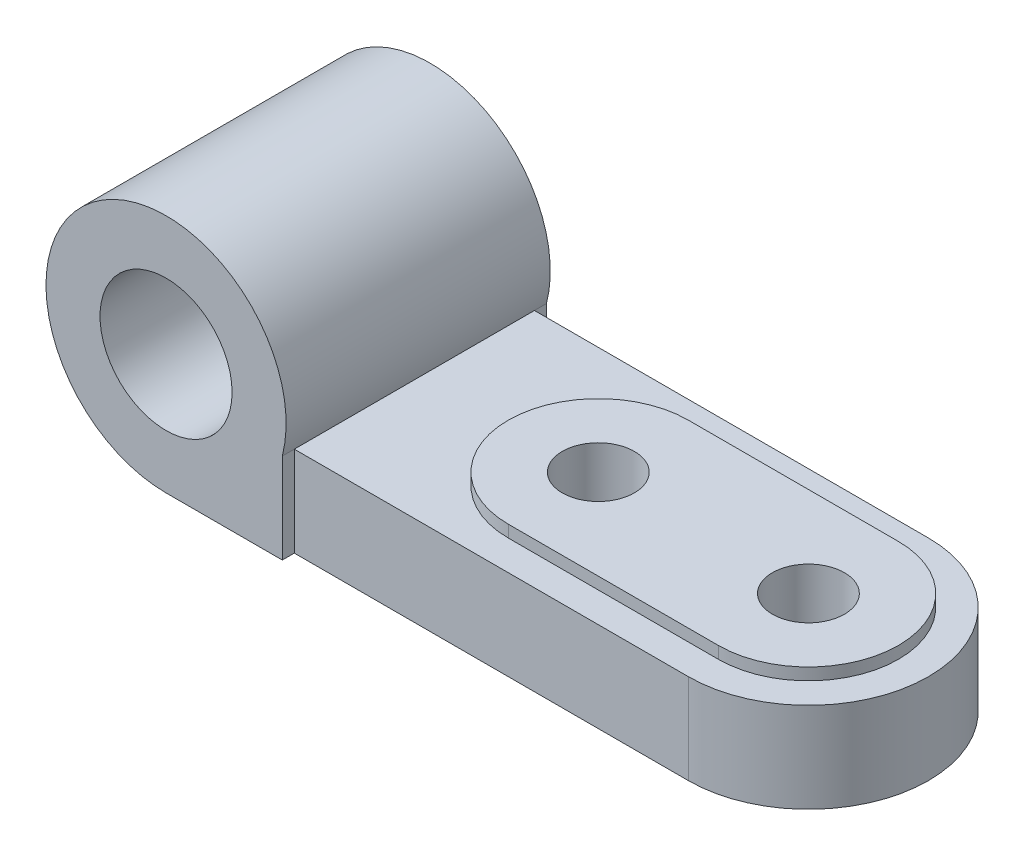
ISO-10303-21;
HEADER;
FILE_DESCRIPTION(('STEP AP214'),'2;1');
FILE_NAME('part.step','',(''),(''),'','','');
FILE_SCHEMA(('AUTOMOTIVE_DESIGN { 1 0 10303 214 1 1 1 1 }'));
ENDSEC;
DATA;
#1=APPLICATION_CONTEXT('core data for automotive mechanical design processes');
#2=APPLICATION_PROTOCOL_DEFINITION('international standard','automotive_design',2000,#1);
#3=PRODUCT_CONTEXT('',#1,'mechanical');
#4=PRODUCT('Part','Part','',(#3));
#5=PRODUCT_RELATED_PRODUCT_CATEGORY('part','',(#4));
#6=PRODUCT_DEFINITION_FORMATION('','',#4);
#7=PRODUCT_DEFINITION_CONTEXT('part definition',#1,'design');
#8=PRODUCT_DEFINITION('design','',#6,#7);
#9=PRODUCT_DEFINITION_SHAPE('','',#8);
#10=(LENGTH_UNIT() NAMED_UNIT(*) SI_UNIT(.MILLI.,.METRE.));
#11=(NAMED_UNIT(*) PLANE_ANGLE_UNIT() SI_UNIT($,.RADIAN.));
#12=(NAMED_UNIT(*) SI_UNIT($,.STERADIAN.) SOLID_ANGLE_UNIT());
#13=UNCERTAINTY_MEASURE_WITH_UNIT(LENGTH_MEASURE(1.E-05),#10,'distance_accuracy_value','');
#14=(GEOMETRIC_REPRESENTATION_CONTEXT(3) GLOBAL_UNCERTAINTY_ASSIGNED_CONTEXT((#13)) GLOBAL_UNIT_ASSIGNED_CONTEXT((#10,
#11,#12)) REPRESENTATION_CONTEXT('',''));
#15=CARTESIAN_POINT('',(0.,0.,0.));
#16=DIRECTION('',(0.,0.,1.));
#17=DIRECTION('',(1.,0.,0.));
#18=AXIS2_PLACEMENT_3D('',#15,#16,#17);
#19=CARTESIAN_POINT('',(0.,-5.,44.));
#20=DIRECTION('',(0.,-1.,0.));
#21=DIRECTION('',(0.,0.,-1.));
#22=AXIS2_PLACEMENT_3D('',#19,#20,#21);
#23=PLANE('',#22);
#24=CARTESIAN_POINT('',(27.1908602150537,-5.,22.));
#25=DIRECTION('',(0.,1.,0.));
#26=DIRECTION('',(0.,0.,1.));
#27=AXIS2_PLACEMENT_3D('',#24,#25,#26);
#28=CIRCLE('',#27,20.);
#29=CARTESIAN_POINT('',(27.1908602150537,-5.,42.));
#30=VERTEX_POINT('',#29);
#31=CARTESIAN_POINT('',(27.1908602150537,-5.,2.));
#32=VERTEX_POINT('',#31);
#33=EDGE_CURVE('E58',#30,#32,#28,.T.);
#34=ORIENTED_EDGE('',*,*,#33,.T.);
#35=DIRECTION('',(1.,0.,0.));
#36=VECTOR('',#35,1.);
#37=CARTESIAN_POINT('',(0.,-5.,2.));
#38=LINE('',#37,#36);
#39=CARTESIAN_POINT('',(-38.4442230539092,-5.,2.));
#40=VERTEX_POINT('',#39);
#41=EDGE_CURVE('E147',#40,#32,#38,.T.);
#42=ORIENTED_EDGE('',*,*,#41,.F.);
#43=DIRECTION('',(0.,0.,-1.));
#44=VECTOR('',#43,1.);
#45=CARTESIAN_POINT('',(-38.4442230539092,-5.,44.));
#46=LINE('',#45,#44);
#47=CARTESIAN_POINT('',(-38.4442230539092,-5.,42.));
#48=VERTEX_POINT('',#47);
#49=EDGE_CURVE('E188',#48,#40,#46,.T.);
#50=ORIENTED_EDGE('',*,*,#49,.F.);
#51=DIRECTION('',(-1.,0.,0.));
#52=VECTOR('',#51,1.);
#53=CARTESIAN_POINT('',(0.,-5.,42.));
#54=LINE('',#53,#52);
#55=EDGE_CURVE('E166',#30,#48,#54,.T.);
#56=ORIENTED_EDGE('',*,*,#55,.F.);
#57=EDGE_LOOP('',(#34,#42,#50,#56));
#58=FACE_BOUND('',#57,.T.);
#59=CARTESIAN_POINT('',(-7.80913978494626,-5.,22.));
#60=DIRECTION('',(0.,1.,0.));
#61=DIRECTION('',(0.,0.,1.));
#62=AXIS2_PLACEMENT_3D('',#59,#60,#61);
#63=CIRCLE('',#62,15.);
#64=CARTESIAN_POINT('',(-7.80913978494626,-5.,7.));
#65=VERTEX_POINT('',#64);
#66=CARTESIAN_POINT('',(-7.80913978494626,-5.,37.));
#67=VERTEX_POINT('',#66);
#68=EDGE_CURVE('E142',#65,#67,#63,.T.);
#69=ORIENTED_EDGE('',*,*,#68,.F.);
#70=DIRECTION('',(1.,0.,0.));
#71=VECTOR('',#70,1.);
#72=CARTESIAN_POINT('',(0.,-5.,7.));
#73=LINE('',#72,#71);
#74=CARTESIAN_POINT('',(27.1908602150537,-5.,7.));
#75=VERTEX_POINT('',#74);
#76=EDGE_CURVE('E138',#65,#75,#73,.T.);
#77=ORIENTED_EDGE('',*,*,#76,.T.);
#78=CARTESIAN_POINT('',(27.1908602150537,-5.,22.));
#79=DIRECTION('',(0.,1.,0.));
#80=DIRECTION('',(0.,0.,1.));
#81=AXIS2_PLACEMENT_3D('',#78,#79,#80);
#82=CIRCLE('',#81,15.);
#83=CARTESIAN_POINT('',(27.1908602150537,-5.,37.));
#84=VERTEX_POINT('',#83);
#85=EDGE_CURVE('E50',#84,#75,#82,.T.);
#86=ORIENTED_EDGE('',*,*,#85,.F.);
#87=DIRECTION('',(1.,0.,0.));
#88=VECTOR('',#87,1.);
#89=CARTESIAN_POINT('',(0.,-5.,37.));
#90=LINE('',#89,#88);
#91=EDGE_CURVE('E300',#67,#84,#90,.T.);
#92=ORIENTED_EDGE('',*,*,#91,.F.);
#93=EDGE_LOOP('',(#69,#77,#86,#92));
#94=FACE_BOUND('',#93,.T.);
#95=ADVANCED_FACE('F35',(#58,#94),#23,.F.);
#96=CARTESIAN_POINT('',(0.,-20.,44.));
#97=DIRECTION('',(0.,1.,0.));
#98=DIRECTION('',(0.,0.,1.));
#99=AXIS2_PLACEMENT_3D('',#96,#97,#98);
#100=PLANE('',#99);
#101=CARTESIAN_POINT('',(27.1908602150537,-20.,22.));
#102=DIRECTION('',(0.,1.,0.));
#103=DIRECTION('',(0.,0.,1.));
#104=AXIS2_PLACEMENT_3D('',#101,#102,#103);
#105=CIRCLE('',#104,6.);
#106=CARTESIAN_POINT('',(27.1908602150537,-20.,28.));
#107=VERTEX_POINT('',#106);
#108=EDGE_CURVE('E297',#107,#107,#105,.T.);
#109=ORIENTED_EDGE('',*,*,#108,.T.);
#110=EDGE_LOOP('',(#109));
#111=FACE_BOUND('',#110,.T.);
#112=CARTESIAN_POINT('',(-7.80913978494626,-20.,22.));
#113=DIRECTION('',(0.,1.,0.));
#114=DIRECTION('',(0.,0.,1.));
#115=AXIS2_PLACEMENT_3D('',#112,#113,#114);
#116=CIRCLE('',#115,6.);
#117=CARTESIAN_POINT('',(-7.80913978494626,-20.,28.));
#118=VERTEX_POINT('',#117);
#119=EDGE_CURVE('E298',#118,#118,#116,.T.);
#120=ORIENTED_EDGE('',*,*,#119,.T.);
#121=EDGE_LOOP('',(#120));
#122=FACE_BOUND('',#121,.T.);
#123=DIRECTION('',(1.,0.,0.));
#124=VECTOR('',#123,1.);
#125=CARTESIAN_POINT('',(0.,-20.,2.));
#126=LINE('',#125,#124);
#127=CARTESIAN_POINT('',(-38.4442230539092,-20.,2.));
#128=VERTEX_POINT('',#127);
#129=CARTESIAN_POINT('',(27.1908602150537,-20.,2.));
#130=VERTEX_POINT('',#129);
#131=EDGE_CURVE('E162',#128,#130,#126,.T.);
#132=ORIENTED_EDGE('',*,*,#131,.T.);
#133=CARTESIAN_POINT('',(27.1908602150537,-20.,22.));
#134=DIRECTION('',(0.,1.,0.));
#135=DIRECTION('',(0.,0.,1.));
#136=AXIS2_PLACEMENT_3D('',#133,#134,#135);
#137=CIRCLE('',#136,20.);
#138=CARTESIAN_POINT('',(27.1908602150537,-20.,42.));
#139=VERTEX_POINT('',#138);
#140=EDGE_CURVE('E182',#139,#130,#137,.T.);
#141=ORIENTED_EDGE('',*,*,#140,.F.);
#142=DIRECTION('',(-1.,0.,0.));
#143=VECTOR('',#142,1.);
#144=CARTESIAN_POINT('',(0.,-20.,42.));
#145=LINE('',#144,#143);
#146=CARTESIAN_POINT('',(-38.4442230539092,-20.,42.));
#147=VERTEX_POINT('',#146);
#148=EDGE_CURVE('E173',#139,#147,#145,.T.);
#149=ORIENTED_EDGE('',*,*,#148,.T.);
#150=DIRECTION('',(0.,0.,1.));
#151=VECTOR('',#150,1.);
#152=CARTESIAN_POINT('',(-38.4442230539092,-20.,44.));
#153=LINE('',#152,#151);
#154=CARTESIAN_POINT('',(-38.4442230539092,-20.,44.));
#155=VERTEX_POINT('',#154);
#156=EDGE_CURVE('E179',#147,#155,#153,.T.);
#157=ORIENTED_EDGE('',*,*,#156,.T.);
#158=DIRECTION('',(1.,0.,0.));
#159=VECTOR('',#158,1.);
#160=CARTESIAN_POINT('',(0.,-20.,44.));
#161=LINE('',#160,#159);
#162=CARTESIAN_POINT('',(-57.8091397849463,-20.,44.));
#163=VERTEX_POINT('',#162);
#164=EDGE_CURVE('E185',#163,#155,#161,.T.);
#165=ORIENTED_EDGE('',*,*,#164,.F.);
#166=DIRECTION('',(0.,0.,-1.));
#167=VECTOR('',#166,1.);
#168=CARTESIAN_POINT('',(-57.8091397849463,-20.,44.));
#169=LINE('',#168,#167);
#170=CARTESIAN_POINT('',(-57.8091397849463,-20.,0.));
#171=VERTEX_POINT('',#170);
#172=EDGE_CURVE('E194',#163,#171,#169,.T.);
#173=ORIENTED_EDGE('',*,*,#172,.T.);
#174=DIRECTION('',(1.,0.,0.));
#175=VECTOR('',#174,1.);
#176=CARTESIAN_POINT('',(0.,-20.,0.));
#177=LINE('',#176,#175);
#178=CARTESIAN_POINT('',(-38.4442230539092,-20.,0.));
#179=VERTEX_POINT('',#178);
#180=EDGE_CURVE('E184',#171,#179,#177,.T.);
#181=ORIENTED_EDGE('',*,*,#180,.T.);
#182=DIRECTION('',(0.,0.,1.));
#183=VECTOR('',#182,1.);
#184=CARTESIAN_POINT('',(-38.4442230539092,-20.,44.));
#185=LINE('',#184,#183);
#186=EDGE_CURVE('E158',#179,#128,#185,.T.);
#187=ORIENTED_EDGE('',*,*,#186,.T.);
#188=EDGE_LOOP('',(#132,#141,#149,#157,#165,#173,#181,#187));
#189=FACE_BOUND('',#188,.T.);
#190=ADVANCED_FACE('F215',(#111,#122,#189),#100,.F.);
#191=CARTESIAN_POINT('',(-57.8091397849463,0.,44.));
#192=DIRECTION('',(0.,0.,-1.));
#193=DIRECTION('',(-1.,0.,0.));
#194=AXIS2_PLACEMENT_3D('',#191,#192,#193);
#195=CYLINDRICAL_SURFACE('',#194,20.);
#196=ORIENTED_EDGE('',*,*,#172,.F.);
#197=CARTESIAN_POINT('',(-57.8091397849463,0.,44.));
#198=DIRECTION('',(0.,0.,1.));
#199=DIRECTION('',(1.,0.,0.));
#200=AXIS2_PLACEMENT_3D('',#197,#198,#199);
#201=CIRCLE('',#200,20.);
#202=CARTESIAN_POINT('',(-38.4442230539092,-5.,44.));
#203=VERTEX_POINT('',#202);
#204=EDGE_CURVE('E43',#203,#163,#201,.T.);
#205=ORIENTED_EDGE('',*,*,#204,.F.);
#206=EDGE_CURVE('E191',#203,#48,#46,.T.);
#207=ORIENTED_EDGE('',*,*,#206,.T.);
#208=ORIENTED_EDGE('',*,*,#49,.T.);
#209=DIRECTION('',(0.,0.,1.));
#210=VECTOR('',#209,1.);
#211=CARTESIAN_POINT('',(-38.4442230539092,-5.,0.));
#212=LINE('',#211,#210);
#213=CARTESIAN_POINT('',(-38.4442230539092,-5.,0.));
#214=VERTEX_POINT('',#213);
#215=EDGE_CURVE('E144',#214,#40,#212,.T.);
#216=ORIENTED_EDGE('',*,*,#215,.F.);
#217=CARTESIAN_POINT('',(-57.8091397849463,0.,0.));
#218=DIRECTION('',(0.,0.,1.));
#219=DIRECTION('',(1.,0.,0.));
#220=AXIS2_PLACEMENT_3D('',#217,#218,#219);
#221=CIRCLE('',#220,20.);
#222=EDGE_CURVE('E201',#214,#171,#221,.T.);
#223=ORIENTED_EDGE('',*,*,#222,.T.);
#224=EDGE_LOOP('',(#196,#205,#207,#208,#216,#223));
#225=FACE_BOUND('',#224,.T.);
#226=ADVANCED_FACE('F208',(#225),#195,.T.);
#227=CARTESIAN_POINT('',(-57.8091397849463,0.,44.));
#228=DIRECTION('',(0.,0.,-1.));
#229=DIRECTION('',(-1.,0.,0.));
#230=AXIS2_PLACEMENT_3D('',#227,#228,#229);
#231=CYLINDRICAL_SURFACE('',#230,11.);
#232=CARTESIAN_POINT('',(-57.8091397849463,0.,44.));
#233=DIRECTION('',(0.,0.,1.));
#234=DIRECTION('',(1.,0.,0.));
#235=AXIS2_PLACEMENT_3D('',#232,#233,#234);
#236=CIRCLE('',#235,11.);
#237=CARTESIAN_POINT('',(-46.8091397849463,0.,44.));
#238=VERTEX_POINT('',#237);
#239=EDGE_CURVE('E198',#238,#238,#236,.T.);
#240=ORIENTED_EDGE('',*,*,#239,.T.);
#241=EDGE_LOOP('',(#240));
#242=FACE_BOUND('',#241,.T.);
#243=CARTESIAN_POINT('',(-57.8091397849463,0.,0.));
#244=DIRECTION('',(0.,0.,1.));
#245=DIRECTION('',(1.,0.,0.));
#246=AXIS2_PLACEMENT_3D('',#243,#244,#245);
#247=CIRCLE('',#246,11.);
#248=CARTESIAN_POINT('',(-46.8091397849463,0.,0.));
#249=VERTEX_POINT('',#248);
#250=EDGE_CURVE('E197',#249,#249,#247,.T.);
#251=ORIENTED_EDGE('',*,*,#250,.F.);
#252=EDGE_LOOP('',(#251));
#253=FACE_BOUND('',#252,.T.);
#254=ADVANCED_FACE('F37',(#242,#253),#231,.F.);
#255=CARTESIAN_POINT('',(0.,0.,44.));
#256=DIRECTION('',(0.,0.,1.));
#257=DIRECTION('',(1.,0.,0.));
#258=AXIS2_PLACEMENT_3D('',#255,#256,#257);
#259=PLANE('',#258);
#260=DIRECTION('',(0.,1.,0.));
#261=VECTOR('',#260,1.);
#262=CARTESIAN_POINT('',(-38.4442230539092,-49.,44.));
#263=LINE('',#262,#261);
#264=EDGE_CURVE('E170',#155,#203,#263,.T.);
#265=ORIENTED_EDGE('',*,*,#264,.T.);
#266=ORIENTED_EDGE('',*,*,#204,.T.);
#267=ORIENTED_EDGE('',*,*,#164,.T.);
#268=EDGE_LOOP('',(#265,#266,#267));
#269=FACE_BOUND('',#268,.T.);
#270=ORIENTED_EDGE('',*,*,#239,.F.);
#271=EDGE_LOOP('',(#270));
#272=FACE_BOUND('',#271,.T.);
#273=ADVANCED_FACE('F236',(#269,#272),#259,.T.);
#274=CARTESIAN_POINT('',(0.,0.,0.));
#275=DIRECTION('',(0.,0.,1.));
#276=DIRECTION('',(1.,0.,0.));
#277=AXIS2_PLACEMENT_3D('',#274,#275,#276);
#278=PLANE('',#277);
#279=ORIENTED_EDGE('',*,*,#250,.T.);
#280=EDGE_LOOP('',(#279));
#281=FACE_BOUND('',#280,.T.);
#282=ORIENTED_EDGE('',*,*,#222,.F.);
#283=DIRECTION('',(0.,-1.,0.));
#284=VECTOR('',#283,1.);
#285=CARTESIAN_POINT('',(-38.4442230539092,0.,0.));
#286=LINE('',#285,#284);
#287=EDGE_CURVE('E11',#214,#179,#286,.T.);
#288=ORIENTED_EDGE('',*,*,#287,.T.);
#289=ORIENTED_EDGE('',*,*,#180,.F.);
#290=EDGE_LOOP('',(#282,#288,#289));
#291=FACE_BOUND('',#290,.T.);
#292=ADVANCED_FACE('F216',(#281,#291),#278,.F.);
#293=CARTESIAN_POINT('',(27.1908602150537,-49.,22.));
#294=DIRECTION('',(0.,1.,0.));
#295=DIRECTION('',(0.,0.,1.));
#296=AXIS2_PLACEMENT_3D('',#293,#294,#295);
#297=CYLINDRICAL_SURFACE('',#296,20.);
#298=ORIENTED_EDGE('',*,*,#140,.T.);
#299=DIRECTION('',(0.,1.,0.));
#300=VECTOR('',#299,1.);
#301=CARTESIAN_POINT('',(27.1908602150537,-49.,2.));
#302=LINE('',#301,#300);
#303=EDGE_CURVE('E156',#130,#32,#302,.T.);
#304=ORIENTED_EDGE('',*,*,#303,.T.);
#305=ORIENTED_EDGE('',*,*,#33,.F.);
#306=DIRECTION('',(0.,1.,0.));
#307=VECTOR('',#306,1.);
#308=CARTESIAN_POINT('',(27.1908602150537,-49.,42.));
#309=LINE('',#308,#307);
#310=EDGE_CURVE('E169',#139,#30,#309,.T.);
#311=ORIENTED_EDGE('',*,*,#310,.F.);
#312=EDGE_LOOP('',(#298,#304,#305,#311));
#313=FACE_BOUND('',#312,.T.);
#314=ADVANCED_FACE('F225',(#313),#297,.T.);
#315=CARTESIAN_POINT('',(-38.4442230539092,-49.,0.));
#316=DIRECTION('',(-1.,0.,0.));
#317=DIRECTION('',(0.,0.,1.));
#318=AXIS2_PLACEMENT_3D('',#315,#316,#317);
#319=PLANE('',#318);
#320=DIRECTION('',(0.,1.,0.));
#321=VECTOR('',#320,1.);
#322=CARTESIAN_POINT('',(-38.4442230539092,-49.,42.));
#323=LINE('',#322,#321);
#324=EDGE_CURVE('E174',#147,#48,#323,.T.);
#325=ORIENTED_EDGE('',*,*,#324,.T.);
#326=ORIENTED_EDGE('',*,*,#206,.F.);
#327=ORIENTED_EDGE('',*,*,#264,.F.);
#328=ORIENTED_EDGE('',*,*,#156,.F.);
#329=EDGE_LOOP('',(#325,#326,#327,#328));
#330=FACE_BOUND('',#329,.T.);
#331=ADVANCED_FACE('F234',(#330),#319,.F.);
#332=CARTESIAN_POINT('',(0.,-49.,42.));
#333=DIRECTION('',(0.,0.,-1.));
#334=DIRECTION('',(-1.,0.,0.));
#335=AXIS2_PLACEMENT_3D('',#332,#333,#334);
#336=PLANE('',#335);
#337=ORIENTED_EDGE('',*,*,#310,.T.);
#338=ORIENTED_EDGE('',*,*,#55,.T.);
#339=ORIENTED_EDGE('',*,*,#324,.F.);
#340=ORIENTED_EDGE('',*,*,#148,.F.);
#341=EDGE_LOOP('',(#337,#338,#339,#340));
#342=FACE_BOUND('',#341,.T.);
#343=ADVANCED_FACE('F228',(#342),#336,.F.);
#344=CARTESIAN_POINT('',(0.,-49.,2.));
#345=DIRECTION('',(0.,0.,1.));
#346=DIRECTION('',(1.,0.,0.));
#347=AXIS2_PLACEMENT_3D('',#344,#345,#346);
#348=PLANE('',#347);
#349=DIRECTION('',(0.,1.,0.));
#350=VECTOR('',#349,1.);
#351=CARTESIAN_POINT('',(-38.4442230539092,-49.,2.));
#352=LINE('',#351,#350);
#353=EDGE_CURVE('E155',#128,#40,#352,.T.);
#354=ORIENTED_EDGE('',*,*,#353,.T.);
#355=ORIENTED_EDGE('',*,*,#41,.T.);
#356=ORIENTED_EDGE('',*,*,#303,.F.);
#357=ORIENTED_EDGE('',*,*,#131,.F.);
#358=EDGE_LOOP('',(#354,#355,#356,#357));
#359=FACE_BOUND('',#358,.T.);
#360=ADVANCED_FACE('F224',(#359),#348,.F.);
#361=CARTESIAN_POINT('',(-38.4442230539092,-49.,0.));
#362=DIRECTION('',(-1.,0.,0.));
#363=DIRECTION('',(0.,0.,1.));
#364=AXIS2_PLACEMENT_3D('',#361,#362,#363);
#365=PLANE('',#364);
#366=ORIENTED_EDGE('',*,*,#287,.F.);
#367=ORIENTED_EDGE('',*,*,#215,.T.);
#368=ORIENTED_EDGE('',*,*,#353,.F.);
#369=ORIENTED_EDGE('',*,*,#186,.F.);
#370=EDGE_LOOP('',(#366,#367,#368,#369));
#371=FACE_BOUND('',#370,.T.);
#372=ADVANCED_FACE('F218',(#371),#365,.F.);
#373=CARTESIAN_POINT('',(-7.80913978494626,-3.,22.));
#374=DIRECTION('',(0.,-1.,0.));
#375=DIRECTION('',(0.,0.,-1.));
#376=AXIS2_PLACEMENT_3D('',#373,#374,#375);
#377=CYLINDRICAL_SURFACE('',#376,15.);
#378=ORIENTED_EDGE('',*,*,#68,.T.);
#379=DIRECTION('',(0.,-1.,0.));
#380=VECTOR('',#379,1.);
#381=CARTESIAN_POINT('',(-7.80913978494626,-3.,37.));
#382=LINE('',#381,#380);
#383=CARTESIAN_POINT('',(-7.80913978494626,-3.,37.));
#384=VERTEX_POINT('',#383);
#385=EDGE_CURVE('E124',#384,#67,#382,.T.);
#386=ORIENTED_EDGE('',*,*,#385,.F.);
#387=CARTESIAN_POINT('',(-7.80913978494626,-3.,22.));
#388=DIRECTION('',(0.,1.,0.));
#389=DIRECTION('',(0.,0.,1.));
#390=AXIS2_PLACEMENT_3D('',#387,#388,#389);
#391=CIRCLE('',#390,15.);
#392=CARTESIAN_POINT('',(-7.80913978494626,-3.,7.));
#393=VERTEX_POINT('',#392);
#394=EDGE_CURVE('E130',#393,#384,#391,.T.);
#395=ORIENTED_EDGE('',*,*,#394,.F.);
#396=DIRECTION('',(0.,-1.,0.));
#397=VECTOR('',#396,1.);
#398=CARTESIAN_POINT('',(-7.80913978494626,-3.,7.));
#399=LINE('',#398,#397);
#400=EDGE_CURVE('E307',#393,#65,#399,.T.);
#401=ORIENTED_EDGE('',*,*,#400,.T.);
#402=EDGE_LOOP('',(#378,#386,#395,#401));
#403=FACE_BOUND('',#402,.T.);
#404=ADVANCED_FACE('F140',(#403),#377,.T.);
#405=CARTESIAN_POINT('',(0.,-3.,37.));
#406=DIRECTION('',(0.,0.,-1.));
#407=DIRECTION('',(-1.,0.,0.));
#408=AXIS2_PLACEMENT_3D('',#405,#406,#407);
#409=PLANE('',#408);
#410=ORIENTED_EDGE('',*,*,#91,.T.);
#411=DIRECTION('',(0.,-1.,0.));
#412=VECTOR('',#411,1.);
#413=CARTESIAN_POINT('',(27.1908602150537,-3.,37.));
#414=LINE('',#413,#412);
#415=CARTESIAN_POINT('',(27.1908602150537,-3.,37.));
#416=VERTEX_POINT('',#415);
#417=EDGE_CURVE('E126',#416,#84,#414,.T.);
#418=ORIENTED_EDGE('',*,*,#417,.F.);
#419=DIRECTION('',(1.,0.,0.));
#420=VECTOR('',#419,1.);
#421=CARTESIAN_POINT('',(0.,-3.,37.));
#422=LINE('',#421,#420);
#423=EDGE_CURVE('E120',#384,#416,#422,.T.);
#424=ORIENTED_EDGE('',*,*,#423,.F.);
#425=ORIENTED_EDGE('',*,*,#385,.T.);
#426=EDGE_LOOP('',(#410,#418,#424,#425));
#427=FACE_BOUND('',#426,.T.);
#428=ADVANCED_FACE('F122',(#427),#409,.F.);
#429=CARTESIAN_POINT('',(27.1908602150537,-3.,22.));
#430=DIRECTION('',(0.,-1.,0.));
#431=DIRECTION('',(0.,0.,-1.));
#432=AXIS2_PLACEMENT_3D('',#429,#430,#431);
#433=CYLINDRICAL_SURFACE('',#432,15.);
#434=ORIENTED_EDGE('',*,*,#85,.T.);
#435=DIRECTION('',(0.,-1.,0.));
#436=VECTOR('',#435,1.);
#437=CARTESIAN_POINT('',(27.1908602150537,-3.,7.));
#438=LINE('',#437,#436);
#439=CARTESIAN_POINT('',(27.1908602150537,-3.,7.));
#440=VERTEX_POINT('',#439);
#441=EDGE_CURVE('E149',#440,#75,#438,.T.);
#442=ORIENTED_EDGE('',*,*,#441,.F.);
#443=CARTESIAN_POINT('',(27.1908602150537,-3.,22.));
#444=DIRECTION('',(0.,1.,0.));
#445=DIRECTION('',(0.,0.,1.));
#446=AXIS2_PLACEMENT_3D('',#443,#444,#445);
#447=CIRCLE('',#446,15.);
#448=EDGE_CURVE('E129',#416,#440,#447,.T.);
#449=ORIENTED_EDGE('',*,*,#448,.F.);
#450=ORIENTED_EDGE('',*,*,#417,.T.);
#451=EDGE_LOOP('',(#434,#442,#449,#450));
#452=FACE_BOUND('',#451,.T.);
#453=ADVANCED_FACE('F272',(#452),#433,.T.);
#454=CARTESIAN_POINT('',(0.,-3.,7.));
#455=DIRECTION('',(0.,0.,-1.));
#456=DIRECTION('',(-1.,0.,0.));
#457=AXIS2_PLACEMENT_3D('',#454,#455,#456);
#458=PLANE('',#457);
#459=ORIENTED_EDGE('',*,*,#76,.F.);
#460=ORIENTED_EDGE('',*,*,#400,.F.);
#461=DIRECTION('',(1.,0.,0.));
#462=VECTOR('',#461,1.);
#463=CARTESIAN_POINT('',(0.,-3.,7.));
#464=LINE('',#463,#462);
#465=EDGE_CURVE('E136',#393,#440,#464,.T.);
#466=ORIENTED_EDGE('',*,*,#465,.T.);
#467=ORIENTED_EDGE('',*,*,#441,.T.);
#468=EDGE_LOOP('',(#459,#460,#466,#467));
#469=FACE_BOUND('',#468,.T.);
#470=ADVANCED_FACE('F275',(#469),#458,.T.);
#471=CARTESIAN_POINT('',(0.,-3.,0.));
#472=DIRECTION('',(0.,1.,0.));
#473=DIRECTION('',(0.,0.,1.));
#474=AXIS2_PLACEMENT_3D('',#471,#472,#473);
#475=PLANE('',#474);
#476=CARTESIAN_POINT('',(27.1908602150537,-3.,22.));
#477=DIRECTION('',(0.,1.,0.));
#478=DIRECTION('',(0.,0.,1.));
#479=AXIS2_PLACEMENT_3D('',#476,#477,#478);
#480=CIRCLE('',#479,6.);
#481=CARTESIAN_POINT('',(27.1908602150537,-3.,28.));
#482=VERTEX_POINT('',#481);
#483=EDGE_CURVE('E294',#482,#482,#480,.T.);
#484=ORIENTED_EDGE('',*,*,#483,.F.);
#485=EDGE_LOOP('',(#484));
#486=FACE_BOUND('',#485,.T.);
#487=CARTESIAN_POINT('',(-7.80913978494626,-3.,22.));
#488=DIRECTION('',(0.,1.,0.));
#489=DIRECTION('',(0.,0.,1.));
#490=AXIS2_PLACEMENT_3D('',#487,#488,#489);
#491=CIRCLE('',#490,6.);
#492=CARTESIAN_POINT('',(-7.80913978494626,-3.,28.));
#493=VERTEX_POINT('',#492);
#494=EDGE_CURVE('E314',#493,#493,#491,.T.);
#495=ORIENTED_EDGE('',*,*,#494,.F.);
#496=EDGE_LOOP('',(#495));
#497=FACE_BOUND('',#496,.T.);
#498=ORIENTED_EDGE('',*,*,#394,.T.);
#499=ORIENTED_EDGE('',*,*,#423,.T.);
#500=ORIENTED_EDGE('',*,*,#448,.T.);
#501=ORIENTED_EDGE('',*,*,#465,.F.);
#502=EDGE_LOOP('',(#498,#499,#500,#501));
#503=FACE_BOUND('',#502,.T.);
#504=ADVANCED_FACE('F134',(#486,#497,#503),#475,.T.);
#505=CARTESIAN_POINT('',(-7.80913978494626,-47.,22.));
#506=DIRECTION('',(0.,1.,0.));
#507=DIRECTION('',(0.,0.,1.));
#508=AXIS2_PLACEMENT_3D('',#505,#506,#507);
#509=CYLINDRICAL_SURFACE('',#508,6.);
#510=ORIENTED_EDGE('',*,*,#494,.T.);
#511=EDGE_LOOP('',(#510));
#512=FACE_BOUND('',#511,.T.);
#513=ORIENTED_EDGE('',*,*,#119,.F.);
#514=EDGE_LOOP('',(#513));
#515=FACE_BOUND('',#514,.T.);
#516=ADVANCED_FACE('F281',(#512,#515),#509,.F.);
#517=CARTESIAN_POINT('',(27.1908602150537,-47.,22.));
#518=DIRECTION('',(0.,1.,0.));
#519=DIRECTION('',(0.,0.,1.));
#520=AXIS2_PLACEMENT_3D('',#517,#518,#519);
#521=CYLINDRICAL_SURFACE('',#520,6.);
#522=ORIENTED_EDGE('',*,*,#483,.T.);
#523=EDGE_LOOP('',(#522));
#524=FACE_BOUND('',#523,.T.);
#525=ORIENTED_EDGE('',*,*,#108,.F.);
#526=EDGE_LOOP('',(#525));
#527=FACE_BOUND('',#526,.T.);
#528=ADVANCED_FACE('F285',(#524,#527),#521,.F.);
#529=CLOSED_SHELL('',(#95,#190,#226,#254,#273,#292,#314,#331,#343,#360,#372,#404,#428,#453,#470,
#504,#516,#528));
#530=MANIFOLD_SOLID_BREP('B2',#529);
#531=ADVANCED_BREP_SHAPE_REPRESENTATION('',(#18,#530),#14);
#532=SHAPE_DEFINITION_REPRESENTATION(#9,#531);
ENDSEC;
END-ISO-10303-21;
